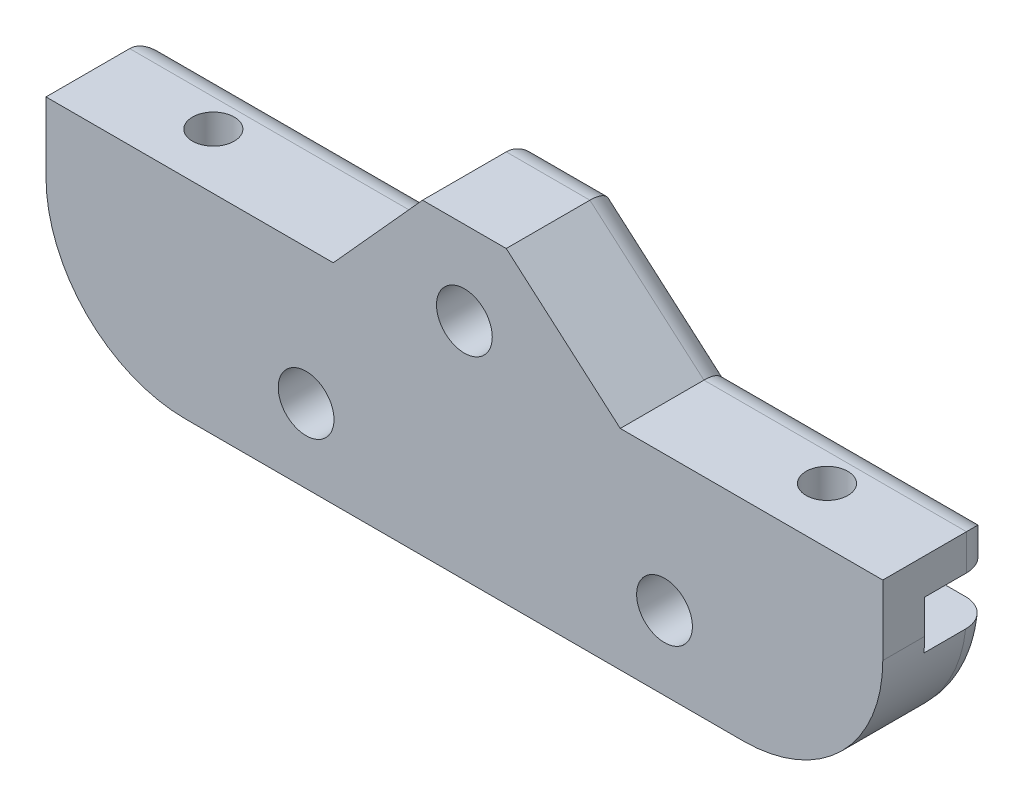
ISO-10303-21;
HEADER;
FILE_DESCRIPTION(('STEP AP214'),'2;1');
FILE_NAME('part.step','',(''),(''),'','','');
FILE_SCHEMA(('AUTOMOTIVE_DESIGN { 1 0 10303 214 1 1 1 1 }'));
ENDSEC;
DATA;
#1=APPLICATION_CONTEXT('core data for automotive mechanical design processes');
#2=APPLICATION_PROTOCOL_DEFINITION('international standard','automotive_design',2000,#1);
#3=PRODUCT_CONTEXT('',#1,'mechanical');
#4=PRODUCT('Part','Part','',(#3));
#5=PRODUCT_RELATED_PRODUCT_CATEGORY('part','',(#4));
#6=PRODUCT_DEFINITION_FORMATION('','',#4);
#7=PRODUCT_DEFINITION_CONTEXT('part definition',#1,'design');
#8=PRODUCT_DEFINITION('design','',#6,#7);
#9=PRODUCT_DEFINITION_SHAPE('','',#8);
#10=(LENGTH_UNIT() NAMED_UNIT(*) SI_UNIT(.MILLI.,.METRE.));
#11=(NAMED_UNIT(*) PLANE_ANGLE_UNIT() SI_UNIT($,.RADIAN.));
#12=(NAMED_UNIT(*) SI_UNIT($,.STERADIAN.) SOLID_ANGLE_UNIT());
#13=UNCERTAINTY_MEASURE_WITH_UNIT(LENGTH_MEASURE(1.E-05),#10,'distance_accuracy_value','');
#14=(GEOMETRIC_REPRESENTATION_CONTEXT(3) GLOBAL_UNCERTAINTY_ASSIGNED_CONTEXT((#13)) GLOBAL_UNIT_ASSIGNED_CONTEXT((#10,
#11,#12)) REPRESENTATION_CONTEXT('',''));
#15=CARTESIAN_POINT('',(0.,0.,0.));
#16=DIRECTION('',(0.,0.,1.));
#17=DIRECTION('',(1.,0.,0.));
#18=AXIS2_PLACEMENT_3D('',#15,#16,#17);
#19=CARTESIAN_POINT('',(0.,0.,1.));
#20=DIRECTION('',(0.,0.,-1.));
#21=DIRECTION('',(-1.,0.,0.));
#22=AXIS2_PLACEMENT_3D('',#19,#20,#21);
#23=PLANE('',#22);
#24=DIRECTION('',(-1.,0.,0.));
#25=VECTOR('',#24,1.);
#26=CARTESIAN_POINT('',(0.,3.65,1.));
#27=LINE('',#26,#25);
#28=CARTESIAN_POINT('',(-23.1180339887499,3.65,1.));
#29=VERTEX_POINT('',#28);
#30=CARTESIAN_POINT('',(-29.9433165477693,3.65,1.));
#31=VERTEX_POINT('',#30);
#32=EDGE_CURVE('E235',#29,#31,#27,.T.);
#33=ORIENTED_EDGE('',*,*,#32,.T.);
#34=CARTESIAN_POINT('',(-20.,4.71322905850847,1.));
#35=DIRECTION('',(0.,0.,-1.));
#36=DIRECTION('',(-1.,0.,0.));
#37=AXIS2_PLACEMENT_3D('',#34,#35,#36);
#38=CIRCLE('',#37,10.);
#39=CARTESIAN_POINT('',(-30.,4.71322905850847,1.));
#40=VERTEX_POINT('',#39);
#41=EDGE_CURVE('E335',#31,#40,#38,.T.);
#42=ORIENTED_EDGE('',*,*,#41,.T.);
#43=DIRECTION('',(0.,1.,0.));
#44=VECTOR('',#43,1.);
#45=CARTESIAN_POINT('',(-30.,0.,1.));
#46=LINE('',#45,#44);
#47=CARTESIAN_POINT('',(-30.,7.15,1.));
#48=VERTEX_POINT('',#47);
#49=EDGE_CURVE('E237',#40,#48,#46,.T.);
#50=ORIENTED_EDGE('',*,*,#49,.T.);
#51=DIRECTION('',(1.,0.,0.));
#52=VECTOR('',#51,1.);
#53=CARTESIAN_POINT('',(0.,7.15,1.));
#54=LINE('',#53,#52);
#55=CARTESIAN_POINT('',(-23.1180339887499,7.15,1.));
#56=VERTEX_POINT('',#55);
#57=EDGE_CURVE('E463',#48,#56,#54,.T.);
#58=ORIENTED_EDGE('',*,*,#57,.T.);
#59=DIRECTION('',(0.,1.,0.));
#60=VECTOR('',#59,1.);
#61=CARTESIAN_POINT('',(-23.1180339887499,-0.592640687119294,1.));
#62=LINE('',#61,#60);
#63=EDGE_CURVE('E313',#56,#29,#62,.F.);
#64=ORIENTED_EDGE('',*,*,#63,.T.);
#65=EDGE_LOOP('',(#33,#42,#50,#58,#64));
#66=FACE_BOUND('',#65,.T.);
#67=ADVANCED_FACE('F43',(#66),#23,.T.);
#68=CARTESIAN_POINT('',(20.8819660112501,3.65,1.));
#69=VERTEX_POINT('',#68);
#70=CARTESIAN_POINT('',(-20.8819660112501,3.65,1.));
#71=VERTEX_POINT('',#70);
#72=EDGE_CURVE('E224',#69,#71,#27,.T.);
#73=ORIENTED_EDGE('',*,*,#72,.T.);
#74=DIRECTION('',(0.,1.,0.));
#75=VECTOR('',#74,1.);
#76=CARTESIAN_POINT('',(-20.8819660112501,-0.592640687119294,1.));
#77=LINE('',#76,#75);
#78=CARTESIAN_POINT('',(-20.8819660112501,7.15,1.));
#79=VERTEX_POINT('',#78);
#80=EDGE_CURVE('E227',#71,#79,#77,.T.);
#81=ORIENTED_EDGE('',*,*,#80,.T.);
#82=CARTESIAN_POINT('',(20.8819660112501,7.15,1.));
#83=VERTEX_POINT('',#82);
#84=EDGE_CURVE('E226',#79,#83,#54,.T.);
#85=ORIENTED_EDGE('',*,*,#84,.T.);
#86=DIRECTION('',(0.,1.,0.));
#87=VECTOR('',#86,1.);
#88=CARTESIAN_POINT('',(20.8819660112501,-0.592640687119287,1.));
#89=LINE('',#88,#87);
#90=EDGE_CURVE('E209',#83,#69,#89,.F.);
#91=ORIENTED_EDGE('',*,*,#90,.T.);
#92=EDGE_LOOP('',(#73,#81,#85,#91));
#93=FACE_BOUND('',#92,.T.);
#94=ADVANCED_FACE('F222',(#93),#23,.T.);
#95=DIRECTION('',(0.,-1.,0.));
#96=VECTOR('',#95,1.);
#97=CARTESIAN_POINT('',(30.,0.,1.));
#98=LINE('',#97,#96);
#99=CARTESIAN_POINT('',(30.,7.15,1.));
#100=VERTEX_POINT('',#99);
#101=CARTESIAN_POINT('',(30.,4.71322905850846,1.));
#102=VERTEX_POINT('',#101);
#103=EDGE_CURVE('E239',#100,#102,#98,.T.);
#104=ORIENTED_EDGE('',*,*,#103,.T.);
#105=CARTESIAN_POINT('',(20.,4.71322905850846,1.));
#106=DIRECTION('',(0.,0.,-1.));
#107=DIRECTION('',(-1.,0.,0.));
#108=AXIS2_PLACEMENT_3D('',#105,#106,#107);
#109=CIRCLE('',#108,10.);
#110=CARTESIAN_POINT('',(29.9433165477693,3.65,1.));
#111=VERTEX_POINT('',#110);
#112=EDGE_CURVE('E319',#102,#111,#109,.T.);
#113=ORIENTED_EDGE('',*,*,#112,.T.);
#114=CARTESIAN_POINT('',(23.1180339887499,3.65,1.));
#115=VERTEX_POINT('',#114);
#116=EDGE_CURVE('E234',#111,#115,#27,.T.);
#117=ORIENTED_EDGE('',*,*,#116,.T.);
#118=DIRECTION('',(0.,1.,0.));
#119=VECTOR('',#118,1.);
#120=CARTESIAN_POINT('',(23.1180339887499,-0.592640687119287,1.));
#121=LINE('',#120,#119);
#122=CARTESIAN_POINT('',(23.1180339887499,7.15,1.));
#123=VERTEX_POINT('',#122);
#124=EDGE_CURVE('E212',#115,#123,#121,.T.);
#125=ORIENTED_EDGE('',*,*,#124,.T.);
#126=EDGE_CURVE('E251',#123,#100,#54,.T.);
#127=ORIENTED_EDGE('',*,*,#126,.T.);
#128=EDGE_LOOP('',(#104,#113,#117,#125,#127));
#129=FACE_BOUND('',#128,.T.);
#130=ADVANCED_FACE('F449',(#129),#23,.T.);
#131=CARTESIAN_POINT('',(0.,0.,-4.));
#132=DIRECTION('',(0.,0.,-1.));
#133=DIRECTION('',(-1.,0.,0.));
#134=AXIS2_PLACEMENT_3D('',#131,#132,#133);
#135=PLANE('',#134);
#136=DIRECTION('',(1.,0.,0.));
#137=VECTOR('',#136,1.);
#138=CARTESIAN_POINT('',(0.,7.15,-4.));
#139=LINE('',#138,#137);
#140=CARTESIAN_POINT('',(-28.,7.15,-4.));
#141=VERTEX_POINT('',#140);
#142=CARTESIAN_POINT('',(28.,7.15,-4.));
#143=VERTEX_POINT('',#142);
#144=EDGE_CURVE('E245',#141,#143,#139,.T.);
#145=ORIENTED_EDGE('',*,*,#144,.F.);
#146=DIRECTION('',(0.,-1.,0.));
#147=VECTOR('',#146,1.);
#148=CARTESIAN_POINT('',(-28.,9.71322905850846,-4.));
#149=LINE('',#148,#147);
#150=CARTESIAN_POINT('',(-28.,7.71322905850846,-4.));
#151=VERTEX_POINT('',#150);
#152=EDGE_CURVE('E512',#141,#151,#149,.F.);
#153=ORIENTED_EDGE('',*,*,#152,.T.);
#154=DIRECTION('',(-1.,0.,0.));
#155=VECTOR('',#154,1.);
#156=CARTESIAN_POINT('',(-9.40150542353064,7.71322905850847,-4.));
#157=LINE('',#156,#155);
#158=CARTESIAN_POINT('',(-8.51296332976873,7.71322905850846,-4.));
#159=VERTEX_POINT('',#158);
#160=EDGE_CURVE('E510',#151,#159,#157,.F.);
#161=ORIENTED_EDGE('',*,*,#160,.T.);
#162=DIRECTION('',(-0.670318033254231,-0.742073941257999,0.));
#163=VECTOR('',#162,1.);
#164=CARTESIAN_POINT('',(-8.5246224735656,7.70032183184914,-4.));
#165=LINE('',#164,#163);
#166=CARTESIAN_POINT('',(-2.11145790623808,14.8,-4.));
#167=VERTEX_POINT('',#166);
#168=EDGE_CURVE('E506',#159,#167,#165,.F.);
#169=ORIENTED_EDGE('',*,*,#168,.T.);
#170=DIRECTION('',(-1.,0.,0.));
#171=VECTOR('',#170,1.);
#172=CARTESIAN_POINT('',(0.,14.8,-4.));
#173=LINE('',#172,#171);
#174=CARTESIAN_POINT('',(2.25389483171771,14.8,-4.));
#175=VERTEX_POINT('',#174);
#176=EDGE_CURVE('E504',#167,#175,#173,.F.);
#177=ORIENTED_EDGE('',*,*,#176,.T.);
#178=DIRECTION('',(-0.755666938729322,0.654956088384142,0.));
#179=VECTOR('',#178,1.);
#180=CARTESIAN_POINT('',(8.29179178319719,9.56679848392303,-4.));
#181=LINE('',#180,#179);
#182=CARTESIAN_POINT('',(10.4303796339964,7.71322905850847,-4.));
#183=VERTEX_POINT('',#182);
#184=EDGE_CURVE('E502',#175,#183,#181,.F.);
#185=ORIENTED_EDGE('',*,*,#184,.T.);
#186=DIRECTION('',(-1.,0.,0.));
#187=VECTOR('',#186,1.);
#188=CARTESIAN_POINT('',(30.,7.71322905850847,-4.));
#189=LINE('',#188,#187);
#190=CARTESIAN_POINT('',(28.,7.71322905850847,-4.));
#191=VERTEX_POINT('',#190);
#192=EDGE_CURVE('E500',#183,#191,#189,.F.);
#193=ORIENTED_EDGE('',*,*,#192,.T.);
#194=DIRECTION('',(0.,1.,0.));
#195=VECTOR('',#194,1.);
#196=CARTESIAN_POINT('',(28.,7.15,-4.));
#197=LINE('',#196,#195);
#198=EDGE_CURVE('E508',#191,#143,#197,.F.);
#199=ORIENTED_EDGE('',*,*,#198,.T.);
#200=EDGE_LOOP('',(#145,#153,#161,#169,#177,#185,#193,#199));
#201=FACE_BOUND('',#200,.T.);
#202=CARTESIAN_POINT('',(0.,10.8,-4.));
#203=DIRECTION('',(0.,0.,1.));
#204=DIRECTION('',(1.,0.,0.));
#205=AXIS2_PLACEMENT_3D('',#202,#203,#204);
#206=CIRCLE('',#205,2.);
#207=CARTESIAN_POINT('',(2.,10.8,-4.));
#208=VERTEX_POINT('',#207);
#209=EDGE_CURVE('E281',#208,#208,#206,.T.);
#210=ORIENTED_EDGE('',*,*,#209,.T.);
#211=EDGE_LOOP('',(#210));
#212=FACE_BOUND('',#211,.T.);
#213=ADVANCED_FACE('F412',(#201,#212),#135,.T.);
#214=CARTESIAN_POINT('',(3.,16.8,-4.));
#215=DIRECTION('',(0.654956088384142,0.755666938729322,0.));
#216=DIRECTION('',(-0.755666938729322,0.654956088384142,0.));
#217=AXIS2_PLACEMENT_3D('',#214,#215,#216);
#218=PLANE('',#217);
#219=DIRECTION('',(0.,0.,-1.));
#220=VECTOR('',#219,1.);
#221=CARTESIAN_POINT('',(11.1764848022787,9.71322905850847,29.4813260804228));
#222=LINE('',#221,#220);
#223=CARTESIAN_POINT('',(11.1764848022787,9.71322905850847,4.));
#224=VERTEX_POINT('',#223);
#225=CARTESIAN_POINT('',(11.1764848022787,9.71322905850847,-2.));
#226=VERTEX_POINT('',#225);
#227=EDGE_CURVE('E260',#224,#226,#222,.T.);
#228=ORIENTED_EDGE('',*,*,#227,.T.);
#229=DIRECTION('',(-0.755666938729322,0.654956088384142,0.));
#230=VECTOR('',#229,1.);
#231=CARTESIAN_POINT('',(3.,16.8,-2.));
#232=LINE('',#231,#230);
#233=CARTESIAN_POINT('',(3.,16.8,-2.));
#234=VERTEX_POINT('',#233);
#235=EDGE_CURVE('E66',#226,#234,#232,.T.);
#236=ORIENTED_EDGE('',*,*,#235,.T.);
#237=DIRECTION('',(0.,0.,1.));
#238=VECTOR('',#237,1.);
#239=CARTESIAN_POINT('',(3.,16.8,-4.));
#240=LINE('',#239,#238);
#241=CARTESIAN_POINT('',(3.,16.8,4.));
#242=VERTEX_POINT('',#241);
#243=EDGE_CURVE('E307',#234,#242,#240,.T.);
#244=ORIENTED_EDGE('',*,*,#243,.T.);
#245=DIRECTION('',(-0.755666938729322,0.654956088384142,0.));
#246=VECTOR('',#245,1.);
#247=CARTESIAN_POINT('',(3.,16.8,4.));
#248=LINE('',#247,#246);
#249=EDGE_CURVE('E298',#224,#242,#248,.T.);
#250=ORIENTED_EDGE('',*,*,#249,.F.);
#251=EDGE_LOOP('',(#228,#236,#244,#250));
#252=FACE_BOUND('',#251,.T.);
#253=ADVANCED_FACE('F417',(#252),#218,.T.);
#254=CARTESIAN_POINT('',(-18.056919343382,0.131274222023489,-4.));
#255=DIRECTION('',(-0.742073941257999,0.670318033254231,0.));
#256=DIRECTION('',(-0.670318033254231,-0.742073941257999,0.));
#257=AXIS2_PLACEMENT_3D('',#254,#255,#256);
#258=PLANE('',#257);
#259=DIRECTION('',(0.,0.,1.));
#260=VECTOR('',#259,1.);
#261=CARTESIAN_POINT('',(-3.,16.8,-4.));
#262=LINE('',#261,#260);
#263=CARTESIAN_POINT('',(-3.,16.8,-2.));
#264=VERTEX_POINT('',#263);
#265=CARTESIAN_POINT('',(-3.,16.8,4.));
#266=VERTEX_POINT('',#265);
#267=EDGE_CURVE('E308',#264,#266,#262,.T.);
#268=ORIENTED_EDGE('',*,*,#267,.F.);
#269=DIRECTION('',(-0.670318033254231,-0.742073941257999,0.));
#270=VECTOR('',#269,1.);
#271=CARTESIAN_POINT('',(-18.056919343382,0.131274222023489,-2.));
#272=LINE('',#271,#270);
#273=CARTESIAN_POINT('',(-9.40150542353064,9.71322905850847,-2.));
#274=VERTEX_POINT('',#273);
#275=EDGE_CURVE('E516',#264,#274,#272,.T.);
#276=ORIENTED_EDGE('',*,*,#275,.T.);
#277=DIRECTION('',(0.,0.,-1.));
#278=VECTOR('',#277,1.);
#279=CARTESIAN_POINT('',(-9.40150542353064,9.71322905850847,29.4813260804228));
#280=LINE('',#279,#278);
#281=CARTESIAN_POINT('',(-9.40150542353064,9.71322905850847,4.));
#282=VERTEX_POINT('',#281);
#283=EDGE_CURVE('E274',#282,#274,#280,.T.);
#284=ORIENTED_EDGE('',*,*,#283,.F.);
#285=DIRECTION('',(-0.670318033254231,-0.742073941257999,0.));
#286=VECTOR('',#285,1.);
#287=CARTESIAN_POINT('',(-18.056919343382,0.131274222023489,4.));
#288=LINE('',#287,#286);
#289=EDGE_CURVE('E304',#266,#282,#288,.T.);
#290=ORIENTED_EDGE('',*,*,#289,.F.);
#291=EDGE_LOOP('',(#268,#276,#284,#290));
#292=FACE_BOUND('',#291,.T.);
#293=ADVANCED_FACE('F413',(#292),#258,.T.);
#294=CARTESIAN_POINT('',(-15.479170983648,-5.28677094149153,-4.));
#295=DIRECTION('',(0.,-1.,0.));
#296=DIRECTION('',(1.,0.,0.));
#297=AXIS2_PLACEMENT_3D('',#294,#295,#296);
#298=PLANE('',#297);
#299=DIRECTION('',(0.,0.,-1.));
#300=VECTOR('',#299,1.);
#301=CARTESIAN_POINT('',(-20.,-5.28677094149153,-4.));
#302=LINE('',#301,#300);
#303=CARTESIAN_POINT('',(-20.,-5.28677094149153,4.));
#304=VERTEX_POINT('',#303);
#305=CARTESIAN_POINT('',(-20.,-5.28677094149153,-2.));
#306=VERTEX_POINT('',#305);
#307=EDGE_CURVE('E326',#304,#306,#302,.T.);
#308=ORIENTED_EDGE('',*,*,#307,.T.);
#309=DIRECTION('',(1.,0.,0.));
#310=VECTOR('',#309,1.);
#311=CARTESIAN_POINT('',(-15.479170983648,-5.28677094149153,-2.));
#312=LINE('',#311,#310);
#313=CARTESIAN_POINT('',(20.,-5.28677094149154,-2.));
#314=VERTEX_POINT('',#313);
#315=EDGE_CURVE('E11',#306,#314,#312,.T.);
#316=ORIENTED_EDGE('',*,*,#315,.T.);
#317=DIRECTION('',(0.,0.,-1.));
#318=VECTOR('',#317,1.);
#319=CARTESIAN_POINT('',(20.,-5.28677094149154,4.));
#320=LINE('',#319,#318);
#321=CARTESIAN_POINT('',(20.,-5.28677094149154,4.));
#322=VERTEX_POINT('',#321);
#323=EDGE_CURVE('E329',#314,#322,#320,.F.);
#324=ORIENTED_EDGE('',*,*,#323,.T.);
#325=DIRECTION('',(1.,0.,0.));
#326=VECTOR('',#325,1.);
#327=CARTESIAN_POINT('',(-15.479170983648,-5.28677094149153,4.));
#328=LINE('',#327,#326);
#329=EDGE_CURVE('E285',#304,#322,#328,.T.);
#330=ORIENTED_EDGE('',*,*,#329,.F.);
#331=EDGE_LOOP('',(#308,#316,#324,#330));
#332=FACE_BOUND('',#331,.T.);
#333=ADVANCED_FACE('F416',(#332),#298,.T.);
#334=CARTESIAN_POINT('',(3.,16.8,-4.));
#335=DIRECTION('',(0.,1.,0.));
#336=DIRECTION('',(0.,0.,1.));
#337=AXIS2_PLACEMENT_3D('',#334,#335,#336);
#338=PLANE('',#337);
#339=ORIENTED_EDGE('',*,*,#243,.F.);
#340=DIRECTION('',(-1.,0.,0.));
#341=VECTOR('',#340,1.);
#342=CARTESIAN_POINT('',(3.,16.8,-2.));
#343=LINE('',#342,#341);
#344=EDGE_CURVE('E520',#234,#264,#343,.T.);
#345=ORIENTED_EDGE('',*,*,#344,.T.);
#346=ORIENTED_EDGE('',*,*,#267,.T.);
#347=DIRECTION('',(-1.,0.,0.));
#348=VECTOR('',#347,1.);
#349=CARTESIAN_POINT('',(3.,16.8,4.));
#350=LINE('',#349,#348);
#351=EDGE_CURVE('E301',#242,#266,#350,.T.);
#352=ORIENTED_EDGE('',*,*,#351,.F.);
#353=EDGE_LOOP('',(#339,#345,#346,#352));
#354=FACE_BOUND('',#353,.T.);
#355=ADVANCED_FACE('F410',(#354),#338,.T.);
#356=DIRECTION('',(1.,0.,0.));
#357=VECTOR('',#356,1.);
#358=CARTESIAN_POINT('',(0.,-3.28677094149154,-4.));
#359=LINE('',#358,#357);
#360=CARTESIAN_POINT('',(20.,-3.28677094149154,-4.));
#361=VERTEX_POINT('',#360);
#362=CARTESIAN_POINT('',(-20.,-3.28677094149153,-4.));
#363=VERTEX_POINT('',#362);
#364=EDGE_CURVE('E339',#361,#363,#359,.F.);
#365=ORIENTED_EDGE('',*,*,#364,.T.);
#366=CARTESIAN_POINT('',(-20.,4.71322905850847,-4.));
#367=DIRECTION('',(0.,0.,-1.));
#368=DIRECTION('',(-1.,0.,0.));
#369=AXIS2_PLACEMENT_3D('',#366,#367,#368);
#370=CIRCLE('',#369,8.);
#371=CARTESIAN_POINT('',(-27.9290317169969,3.65,-4.));
#372=VERTEX_POINT('',#371);
#373=EDGE_CURVE('E343',#363,#372,#370,.T.);
#374=ORIENTED_EDGE('',*,*,#373,.T.);
#375=DIRECTION('',(-1.,0.,0.));
#376=VECTOR('',#375,1.);
#377=CARTESIAN_POINT('',(0.,3.65,-4.));
#378=LINE('',#377,#376);
#379=CARTESIAN_POINT('',(27.9290317169969,3.65,-4.));
#380=VERTEX_POINT('',#379);
#381=EDGE_CURVE('E248',#380,#372,#378,.T.);
#382=ORIENTED_EDGE('',*,*,#381,.F.);
#383=CARTESIAN_POINT('',(20.,4.71322905850846,-4.));
#384=DIRECTION('',(0.,0.,-1.));
#385=DIRECTION('',(-1.,0.,0.));
#386=AXIS2_PLACEMENT_3D('',#383,#384,#385);
#387=CIRCLE('',#386,8.);
#388=EDGE_CURVE('E341',#380,#361,#387,.T.);
#389=ORIENTED_EDGE('',*,*,#388,.T.);
#390=EDGE_LOOP('',(#365,#374,#382,#389));
#391=FACE_BOUND('',#390,.T.);
#392=CARTESIAN_POINT('',(-11.35,0.,-4.));
#393=DIRECTION('',(0.,0.,1.));
#394=DIRECTION('',(1.,0.,0.));
#395=AXIS2_PLACEMENT_3D('',#392,#393,#394);
#396=CIRCLE('',#395,2.);
#397=CARTESIAN_POINT('',(-9.35,0.,-4.));
#398=VERTEX_POINT('',#397);
#399=EDGE_CURVE('E286',#398,#398,#396,.T.);
#400=ORIENTED_EDGE('',*,*,#399,.T.);
#401=EDGE_LOOP('',(#400));
#402=FACE_BOUND('',#401,.T.);
#403=CARTESIAN_POINT('',(14.35,0.,-4.));
#404=DIRECTION('',(0.,0.,1.));
#405=DIRECTION('',(1.,0.,0.));
#406=AXIS2_PLACEMENT_3D('',#403,#404,#405);
#407=CIRCLE('',#406,2.);
#408=CARTESIAN_POINT('',(16.35,0.,-4.));
#409=VERTEX_POINT('',#408);
#410=EDGE_CURVE('E270',#409,#409,#407,.T.);
#411=ORIENTED_EDGE('',*,*,#410,.T.);
#412=EDGE_LOOP('',(#411));
#413=FACE_BOUND('',#412,.T.);
#414=ADVANCED_FACE('F406',(#391,#402,#413),#135,.T.);
#415=CARTESIAN_POINT('',(0.,0.,4.));
#416=DIRECTION('',(0.,0.,-1.));
#417=DIRECTION('',(-1.,0.,0.));
#418=AXIS2_PLACEMENT_3D('',#415,#416,#417);
#419=PLANE('',#418);
#420=ORIENTED_EDGE('',*,*,#329,.T.);
#421=CARTESIAN_POINT('',(20.,4.71322905850846,4.));
#422=DIRECTION('',(0.,0.,-1.));
#423=DIRECTION('',(-1.,0.,0.));
#424=AXIS2_PLACEMENT_3D('',#421,#422,#423);
#425=CIRCLE('',#424,10.);
#426=CARTESIAN_POINT('',(30.,4.71322905850846,4.));
#427=VERTEX_POINT('',#426);
#428=EDGE_CURVE('E333',#322,#427,#425,.F.);
#429=ORIENTED_EDGE('',*,*,#428,.T.);
#430=DIRECTION('',(0.,-1.,0.));
#431=VECTOR('',#430,1.);
#432=CARTESIAN_POINT('',(30.,-5.28677094149153,4.));
#433=LINE('',#432,#431);
#434=CARTESIAN_POINT('',(30.,9.71322905850847,4.));
#435=VERTEX_POINT('',#434);
#436=EDGE_CURVE('E255',#435,#427,#433,.T.);
#437=ORIENTED_EDGE('',*,*,#436,.F.);
#438=DIRECTION('',(1.,0.,0.));
#439=VECTOR('',#438,1.);
#440=CARTESIAN_POINT('',(30.,9.71322905850847,4.));
#441=LINE('',#440,#439);
#442=EDGE_CURVE('E261',#224,#435,#441,.T.);
#443=ORIENTED_EDGE('',*,*,#442,.F.);
#444=ORIENTED_EDGE('',*,*,#249,.T.);
#445=ORIENTED_EDGE('',*,*,#351,.T.);
#446=ORIENTED_EDGE('',*,*,#289,.T.);
#447=DIRECTION('',(1.,0.,0.));
#448=VECTOR('',#447,1.);
#449=CARTESIAN_POINT('',(-9.40150542353064,9.71322905850847,4.));
#450=LINE('',#449,#448);
#451=CARTESIAN_POINT('',(-30.,9.71322905850846,4.));
#452=VERTEX_POINT('',#451);
#453=EDGE_CURVE('E271',#452,#282,#450,.T.);
#454=ORIENTED_EDGE('',*,*,#453,.F.);
#455=DIRECTION('',(0.,1.,0.));
#456=VECTOR('',#455,1.);
#457=CARTESIAN_POINT('',(-30.,-5.28677094149154,4.));
#458=LINE('',#457,#456);
#459=CARTESIAN_POINT('',(-30.,4.71322905850847,4.));
#460=VERTEX_POINT('',#459);
#461=EDGE_CURVE('E268',#460,#452,#458,.T.);
#462=ORIENTED_EDGE('',*,*,#461,.F.);
#463=CARTESIAN_POINT('',(-20.,4.71322905850847,4.));
#464=DIRECTION('',(0.,0.,-1.));
#465=DIRECTION('',(-1.,0.,0.));
#466=AXIS2_PLACEMENT_3D('',#463,#464,#465);
#467=CIRCLE('',#466,10.);
#468=EDGE_CURVE('E331',#460,#304,#467,.F.);
#469=ORIENTED_EDGE('',*,*,#468,.T.);
#470=EDGE_LOOP('',(#420,#429,#437,#443,#444,#445,#446,#454,#462,#469));
#471=FACE_BOUND('',#470,.T.);
#472=CARTESIAN_POINT('',(0.,10.8,4.));
#473=DIRECTION('',(0.,0.,1.));
#474=DIRECTION('',(1.,0.,0.));
#475=AXIS2_PLACEMENT_3D('',#472,#473,#474);
#476=CIRCLE('',#475,2.);
#477=CARTESIAN_POINT('',(2.,10.8,4.));
#478=VERTEX_POINT('',#477);
#479=EDGE_CURVE('E278',#478,#478,#476,.T.);
#480=ORIENTED_EDGE('',*,*,#479,.F.);
#481=EDGE_LOOP('',(#480));
#482=FACE_BOUND('',#481,.T.);
#483=CARTESIAN_POINT('',(-11.35,0.,4.));
#484=DIRECTION('',(0.,0.,1.));
#485=DIRECTION('',(1.,0.,0.));
#486=AXIS2_PLACEMENT_3D('',#483,#484,#485);
#487=CIRCLE('',#486,2.);
#488=CARTESIAN_POINT('',(-9.35,0.,4.));
#489=VERTEX_POINT('',#488);
#490=EDGE_CURVE('E282',#489,#489,#487,.T.);
#491=ORIENTED_EDGE('',*,*,#490,.F.);
#492=EDGE_LOOP('',(#491));
#493=FACE_BOUND('',#492,.T.);
#494=CARTESIAN_POINT('',(14.35,0.,4.));
#495=DIRECTION('',(0.,0.,1.));
#496=DIRECTION('',(1.,0.,0.));
#497=AXIS2_PLACEMENT_3D('',#494,#495,#496);
#498=CIRCLE('',#497,2.);
#499=CARTESIAN_POINT('',(16.35,0.,4.));
#500=VERTEX_POINT('',#499);
#501=EDGE_CURVE('E289',#500,#500,#498,.T.);
#502=ORIENTED_EDGE('',*,*,#501,.F.);
#503=EDGE_LOOP('',(#502));
#504=FACE_BOUND('',#503,.T.);
#505=ADVANCED_FACE('F402',(#471,#482,#493,#504),#419,.F.);
#506=CARTESIAN_POINT('',(14.35,0.,-4.));
#507=DIRECTION('',(0.,0.,1.));
#508=DIRECTION('',(1.,0.,0.));
#509=AXIS2_PLACEMENT_3D('',#506,#507,#508);
#510=CYLINDRICAL_SURFACE('',#509,2.);
#511=ORIENTED_EDGE('',*,*,#410,.F.);
#512=EDGE_LOOP('',(#511));
#513=FACE_BOUND('',#512,.T.);
#514=ORIENTED_EDGE('',*,*,#501,.T.);
#515=EDGE_LOOP('',(#514));
#516=FACE_BOUND('',#515,.T.);
#517=ADVANCED_FACE('F398',(#513,#516),#510,.F.);
#518=CARTESIAN_POINT('',(-11.35,0.,-4.));
#519=DIRECTION('',(0.,0.,1.));
#520=DIRECTION('',(1.,0.,0.));
#521=AXIS2_PLACEMENT_3D('',#518,#519,#520);
#522=CYLINDRICAL_SURFACE('',#521,2.);
#523=ORIENTED_EDGE('',*,*,#399,.F.);
#524=EDGE_LOOP('',(#523));
#525=FACE_BOUND('',#524,.T.);
#526=ORIENTED_EDGE('',*,*,#490,.T.);
#527=EDGE_LOOP('',(#526));
#528=FACE_BOUND('',#527,.T.);
#529=ADVANCED_FACE('F394',(#525,#528),#522,.F.);
#530=CARTESIAN_POINT('',(0.,10.8,-4.));
#531=DIRECTION('',(0.,0.,1.));
#532=DIRECTION('',(1.,0.,0.));
#533=AXIS2_PLACEMENT_3D('',#530,#531,#532);
#534=CYLINDRICAL_SURFACE('',#533,2.);
#535=ORIENTED_EDGE('',*,*,#209,.F.);
#536=EDGE_LOOP('',(#535));
#537=FACE_BOUND('',#536,.T.);
#538=ORIENTED_EDGE('',*,*,#479,.T.);
#539=EDGE_LOOP('',(#538));
#540=FACE_BOUND('',#539,.T.);
#541=ADVANCED_FACE('F387',(#537,#540),#534,.F.);
#542=CARTESIAN_POINT('',(-9.40150542353064,9.71322905850847,29.4813260804228));
#543=DIRECTION('',(0.,-1.,0.));
#544=DIRECTION('',(1.,0.,0.));
#545=AXIS2_PLACEMENT_3D('',#542,#543,#544);
#546=PLANE('',#545);
#547=CARTESIAN_POINT('',(-22.,9.71322905850846,0.));
#548=DIRECTION('',(0.,-1.,0.));
#549=DIRECTION('',(1.,0.,0.));
#550=AXIS2_PLACEMENT_3D('',#547,#548,#549);
#551=CIRCLE('',#550,1.5);
#552=CARTESIAN_POINT('',(-20.5,9.71322905850846,0.));
#553=VERTEX_POINT('',#552);
#554=EDGE_CURVE('E471',#553,#553,#551,.T.);
#555=ORIENTED_EDGE('',*,*,#554,.T.);
#556=EDGE_LOOP('',(#555));
#557=FACE_BOUND('',#556,.T.);
#558=ORIENTED_EDGE('',*,*,#283,.T.);
#559=DIRECTION('',(-1.,0.,0.));
#560=VECTOR('',#559,1.);
#561=CARTESIAN_POINT('',(-30.,9.71322905850846,-2.));
#562=LINE('',#561,#560);
#563=CARTESIAN_POINT('',(-30.,9.71322905850846,-2.));
#564=VERTEX_POINT('',#563);
#565=EDGE_CURVE('E518',#274,#564,#562,.T.);
#566=ORIENTED_EDGE('',*,*,#565,.T.);
#567=DIRECTION('',(0.,0.,-1.));
#568=VECTOR('',#567,1.);
#569=CARTESIAN_POINT('',(-30.,9.71322905850846,29.4813260804228));
#570=LINE('',#569,#568);
#571=EDGE_CURVE('E263',#452,#564,#570,.T.);
#572=ORIENTED_EDGE('',*,*,#571,.F.);
#573=ORIENTED_EDGE('',*,*,#453,.T.);
#574=EDGE_LOOP('',(#558,#566,#572,#573));
#575=FACE_BOUND('',#574,.T.);
#576=ADVANCED_FACE('F384',(#557,#575),#546,.F.);
#577=CARTESIAN_POINT('',(-30.,-5.28677094149154,29.4813260804228));
#578=DIRECTION('',(1.,0.,0.));
#579=DIRECTION('',(0.,0.,-1.));
#580=AXIS2_PLACEMENT_3D('',#577,#578,#579);
#581=PLANE('',#580);
#582=ORIENTED_EDGE('',*,*,#571,.T.);
#583=DIRECTION('',(0.,-1.,0.));
#584=VECTOR('',#583,1.);
#585=CARTESIAN_POINT('',(-30.,7.15,-2.));
#586=LINE('',#585,#584);
#587=CARTESIAN_POINT('',(-30.,7.15,-2.));
#588=VERTEX_POINT('',#587);
#589=EDGE_CURVE('E490',#564,#588,#586,.T.);
#590=ORIENTED_EDGE('',*,*,#589,.T.);
#591=DIRECTION('',(0.,0.,-1.));
#592=VECTOR('',#591,1.);
#593=CARTESIAN_POINT('',(-30.,7.15,1.));
#594=LINE('',#593,#592);
#595=EDGE_CURVE('E252',#48,#588,#594,.T.);
#596=ORIENTED_EDGE('',*,*,#595,.F.);
#597=ORIENTED_EDGE('',*,*,#49,.F.);
#598=DIRECTION('',(0.,0.,-1.));
#599=VECTOR('',#598,1.);
#600=CARTESIAN_POINT('',(-30.,4.71322905850847,4.));
#601=LINE('',#600,#599);
#602=EDGE_CURVE('E337',#40,#460,#601,.F.);
#603=ORIENTED_EDGE('',*,*,#602,.T.);
#604=ORIENTED_EDGE('',*,*,#461,.T.);
#605=EDGE_LOOP('',(#582,#590,#596,#597,#603,#604));
#606=FACE_BOUND('',#605,.T.);
#607=ADVANCED_FACE('F382',(#606),#581,.F.);
#608=CARTESIAN_POINT('',(30.,9.71322905850847,29.4813260804228));
#609=DIRECTION('',(0.,-1.,0.));
#610=DIRECTION('',(1.,0.,0.));
#611=AXIS2_PLACEMENT_3D('',#608,#609,#610);
#612=PLANE('',#611);
#613=CARTESIAN_POINT('',(22.,9.71322905850847,0.));
#614=DIRECTION('',(0.,-1.,0.));
#615=DIRECTION('',(1.,0.,0.));
#616=AXIS2_PLACEMENT_3D('',#613,#614,#615);
#617=CIRCLE('',#616,1.5);
#618=CARTESIAN_POINT('',(23.5,9.71322905850847,0.));
#619=VERTEX_POINT('',#618);
#620=EDGE_CURVE('E216',#619,#619,#617,.T.);
#621=ORIENTED_EDGE('',*,*,#620,.T.);
#622=EDGE_LOOP('',(#621));
#623=FACE_BOUND('',#622,.T.);
#624=DIRECTION('',(0.,0.,-1.));
#625=VECTOR('',#624,1.);
#626=CARTESIAN_POINT('',(30.,9.71322905850847,29.4813260804228));
#627=LINE('',#626,#625);
#628=CARTESIAN_POINT('',(30.,9.71322905850847,-2.));
#629=VERTEX_POINT('',#628);
#630=EDGE_CURVE('E258',#435,#629,#627,.T.);
#631=ORIENTED_EDGE('',*,*,#630,.T.);
#632=DIRECTION('',(-1.,0.,0.));
#633=VECTOR('',#632,1.);
#634=CARTESIAN_POINT('',(11.1764848022787,9.71322905850847,-2.));
#635=LINE('',#634,#633);
#636=EDGE_CURVE('E52',#629,#226,#635,.T.);
#637=ORIENTED_EDGE('',*,*,#636,.T.);
#638=ORIENTED_EDGE('',*,*,#227,.F.);
#639=ORIENTED_EDGE('',*,*,#442,.T.);
#640=EDGE_LOOP('',(#631,#637,#638,#639));
#641=FACE_BOUND('',#640,.T.);
#642=ADVANCED_FACE('F378',(#623,#641),#612,.F.);
#643=CARTESIAN_POINT('',(30.,-5.28677094149153,29.4813260804228));
#644=DIRECTION('',(-1.,0.,0.));
#645=DIRECTION('',(0.,0.,1.));
#646=AXIS2_PLACEMENT_3D('',#643,#644,#645);
#647=PLANE('',#646);
#648=DIRECTION('',(0.,0.,-1.));
#649=VECTOR('',#648,1.);
#650=CARTESIAN_POINT('',(30.,7.15,1.));
#651=LINE('',#650,#649);
#652=CARTESIAN_POINT('',(30.,7.15,-2.));
#653=VERTEX_POINT('',#652);
#654=EDGE_CURVE('E244',#100,#653,#651,.T.);
#655=ORIENTED_EDGE('',*,*,#654,.T.);
#656=DIRECTION('',(0.,1.,0.));
#657=VECTOR('',#656,1.);
#658=CARTESIAN_POINT('',(30.,9.71322905850847,-2.));
#659=LINE('',#658,#657);
#660=EDGE_CURVE('E514',#653,#629,#659,.T.);
#661=ORIENTED_EDGE('',*,*,#660,.T.);
#662=ORIENTED_EDGE('',*,*,#630,.F.);
#663=ORIENTED_EDGE('',*,*,#436,.T.);
#664=DIRECTION('',(0.,0.,-1.));
#665=VECTOR('',#664,1.);
#666=CARTESIAN_POINT('',(30.,4.71322905850846,-4.));
#667=LINE('',#666,#665);
#668=EDGE_CURVE('E316',#427,#102,#667,.T.);
#669=ORIENTED_EDGE('',*,*,#668,.T.);
#670=ORIENTED_EDGE('',*,*,#103,.F.);
#671=EDGE_LOOP('',(#655,#661,#662,#663,#669,#670));
#672=FACE_BOUND('',#671,.T.);
#673=ADVANCED_FACE('F374',(#672),#647,.F.);
#674=CARTESIAN_POINT('',(0.,7.15,1.));
#675=DIRECTION('',(0.,1.,0.));
#676=DIRECTION('',(0.,0.,1.));
#677=AXIS2_PLACEMENT_3D('',#674,#675,#676);
#678=PLANE('',#677);
#679=ORIENTED_EDGE('',*,*,#595,.T.);
#680=CARTESIAN_POINT('',(-28.,7.15,-2.));
#681=DIRECTION('',(0.,1.,0.));
#682=DIRECTION('',(0.,0.,1.));
#683=AXIS2_PLACEMENT_3D('',#680,#681,#682);
#684=CIRCLE('',#683,2.);
#685=EDGE_CURVE('E498',#588,#141,#684,.F.);
#686=ORIENTED_EDGE('',*,*,#685,.T.);
#687=ORIENTED_EDGE('',*,*,#144,.T.);
#688=CARTESIAN_POINT('',(28.,7.15,-2.));
#689=DIRECTION('',(0.,1.,0.));
#690=DIRECTION('',(0.,0.,1.));
#691=AXIS2_PLACEMENT_3D('',#688,#689,#690);
#692=CIRCLE('',#691,2.);
#693=EDGE_CURVE('E494',#143,#653,#692,.F.);
#694=ORIENTED_EDGE('',*,*,#693,.T.);
#695=ORIENTED_EDGE('',*,*,#654,.F.);
#696=ORIENTED_EDGE('',*,*,#126,.F.);
#697=CARTESIAN_POINT('',(22.,7.15,0.));
#698=DIRECTION('',(0.,1.,0.));
#699=DIRECTION('',(0.,0.,1.));
#700=AXIS2_PLACEMENT_3D('',#697,#698,#699);
#701=CIRCLE('',#700,1.5);
#702=EDGE_CURVE('E468',#83,#123,#701,.F.);
#703=ORIENTED_EDGE('',*,*,#702,.F.);
#704=ORIENTED_EDGE('',*,*,#84,.F.);
#705=CARTESIAN_POINT('',(-22.,7.15,0.));
#706=DIRECTION('',(0.,1.,0.));
#707=DIRECTION('',(0.,0.,1.));
#708=AXIS2_PLACEMENT_3D('',#705,#706,#707);
#709=CIRCLE('',#708,1.5);
#710=EDGE_CURVE('E249',#56,#79,#709,.F.);
#711=ORIENTED_EDGE('',*,*,#710,.F.);
#712=ORIENTED_EDGE('',*,*,#57,.F.);
#713=EDGE_LOOP('',(#679,#686,#687,#694,#695,#696,#703,#704,#711,#712));
#714=FACE_BOUND('',#713,.T.);
#715=ADVANCED_FACE('F369',(#714),#678,.F.);
#716=CARTESIAN_POINT('',(0.,3.65,1.));
#717=DIRECTION('',(0.,-1.,0.));
#718=DIRECTION('',(0.,0.,-1.));
#719=AXIS2_PLACEMENT_3D('',#716,#717,#718);
#720=PLANE('',#719);
#721=ORIENTED_EDGE('',*,*,#381,.T.);
#722=CARTESIAN_POINT('',(-27.9290317169969,3.65,-4.));
#723=CARTESIAN_POINT('',(-27.9860355331498,3.65,-3.99999941715019));
#724=CARTESIAN_POINT('',(-28.0430125580419,3.65,-3.9976044588539));
#725=CARTESIAN_POINT('',(-28.1565637956732,3.65,-3.98804308466886));
#726=CARTESIAN_POINT('',(-28.2131380145296,3.65,-3.98087674139949));
#727=CARTESIAN_POINT('',(-28.3815816622004,3.65,-3.95227254380897));
#728=CARTESIAN_POINT('',(-28.4923297608002,3.65,-3.92372940804471));
#729=CARTESIAN_POINT('',(-28.7074669690375,3.65,-3.84841976328557));
#730=CARTESIAN_POINT('',(-28.8118519690729,3.65,-3.8016416184476));
#731=CARTESIAN_POINT('',(-29.0112183488468,3.65,-3.69114329908933));
#732=CARTESIAN_POINT('',(-29.1062023041889,3.65,-3.6274277826299));
#733=CARTESIAN_POINT('',(-29.2835471519478,3.65,-3.4851953199911));
#734=CARTESIAN_POINT('',(-29.3659702095432,3.65,-3.40675586061652));
#735=CARTESIAN_POINT('',(-29.5163869070608,3.65,-3.23704771542643));
#736=CARTESIAN_POINT('',(-29.5843777887898,3.65,-3.14577658282695));
#737=CARTESIAN_POINT('',(-29.7035054629956,3.65,-2.95367289272323));
#738=CARTESIAN_POINT('',(-29.754750040435,3.65,-2.85290708567984));
#739=CARTESIAN_POINT('',(-29.8394705943511,3.65,-2.64419658136118));
#740=CARTESIAN_POINT('',(-29.8729585414961,3.65,-2.5362567758354));
#741=CARTESIAN_POINT('',(-29.9124508019425,3.65,-2.35632448411963));
#742=CARTESIAN_POINT('',(-29.9240188630915,3.65,-2.28550439749014));
#743=CARTESIAN_POINT('',(-29.9394501932121,3.65,-2.1431331901111));
#744=CARTESIAN_POINT('',(-29.9433245363482,3.65,-2.0715832692995));
#745=CARTESIAN_POINT('',(-29.9433165477693,3.65,-2.));
#746=B_SPLINE_CURVE_WITH_KNOTS('',3,(#722,#723,#724,#725,#726,#727,#728,#729,#730,#731,#732,
#733,#734,#735,#736,#737,#738,#739,#740,#741,#742,#743,#744,#745),.UNSPECIFIED.,.F.,.F.,(4,2,2,
2,2,2,2,2,2,2,2,4),(0.,0.170907620978815,0.341812640842188,0.683155631655444,1.02471679248557,
1.36618411528388,1.70590239135744,2.04568553406765,2.38323654814471,2.72055971126486,
2.93544923034848,3.15002921745299),.UNSPECIFIED.);
#747=CARTESIAN_POINT('',(-29.9433165477693,3.65,-2.));
#748=VERTEX_POINT('',#747);
#749=EDGE_CURVE('E354',#372,#748,#746,.T.);
#750=ORIENTED_EDGE('',*,*,#749,.T.);
#751=DIRECTION('',(0.,0.,1.));
#752=VECTOR('',#751,1.);
#753=CARTESIAN_POINT('',(-29.9433165477693,3.65,-4.));
#754=LINE('',#753,#752);
#755=EDGE_CURVE('E321',#748,#31,#754,.T.);
#756=ORIENTED_EDGE('',*,*,#755,.T.);
#757=ORIENTED_EDGE('',*,*,#32,.F.);
#758=CARTESIAN_POINT('',(-22.,3.65,0.));
#759=DIRECTION('',(0.,-1.,0.));
#760=DIRECTION('',(0.,0.,-1.));
#761=AXIS2_PLACEMENT_3D('',#758,#759,#760);
#762=CIRCLE('',#761,1.5);
#763=EDGE_CURVE('E232',#71,#29,#762,.T.);
#764=ORIENTED_EDGE('',*,*,#763,.F.);
#765=ORIENTED_EDGE('',*,*,#72,.F.);
#766=CARTESIAN_POINT('',(22.,3.65,0.));
#767=DIRECTION('',(0.,-1.,0.));
#768=DIRECTION('',(0.,0.,-1.));
#769=AXIS2_PLACEMENT_3D('',#766,#767,#768);
#770=CIRCLE('',#769,1.5);
#771=EDGE_CURVE('E206',#115,#69,#770,.T.);
#772=ORIENTED_EDGE('',*,*,#771,.F.);
#773=ORIENTED_EDGE('',*,*,#116,.F.);
#774=DIRECTION('',(0.,0.,1.));
#775=VECTOR('',#774,1.);
#776=CARTESIAN_POINT('',(29.9433165477693,3.65,1.));
#777=LINE('',#776,#775);
#778=CARTESIAN_POINT('',(29.9433165477693,3.65,-2.));
#779=VERTEX_POINT('',#778);
#780=EDGE_CURVE('E323',#111,#779,#777,.F.);
#781=ORIENTED_EDGE('',*,*,#780,.T.);
#782=CARTESIAN_POINT('',(29.9433165477693,3.65,-2.));
#783=CARTESIAN_POINT('',(29.9433163087709,3.65,-2.05602337735078));
#784=CARTESIAN_POINT('',(29.9409476666944,3.65,-2.11201984968875));
#785=CARTESIAN_POINT('',(29.9314991112219,3.65,-2.22361061197294));
#786=CARTESIAN_POINT('',(29.9244194673923,3.65,-2.27920492474699));
#787=CARTESIAN_POINT('',(29.8961856233697,3.65,-2.44467425555198));
#788=CARTESIAN_POINT('',(29.8680362981547,3.65,-2.55343849393203));
#789=CARTESIAN_POINT('',(29.7938859702845,3.65,-2.76469032684293));
#790=CARTESIAN_POINT('',(29.7478772114548,3.65,-2.86717517187469));
#791=CARTESIAN_POINT('',(29.6393465484045,3.65,-3.06298839788939));
#792=CARTESIAN_POINT('',(29.5768269171452,3.65,-3.15631803679575));
#793=CARTESIAN_POINT('',(29.4369241833026,3.65,-3.33140256607964));
#794=CARTESIAN_POINT('',(29.3595092504313,3.65,-3.41313200570537));
#795=CARTESIAN_POINT('',(29.1921069719522,3.65,-3.5625343188779));
#796=CARTESIAN_POINT('',(29.1021172060833,3.65,-3.63020448020446));
#797=CARTESIAN_POINT('',(28.9116086034849,3.65,-3.74996208657175));
#798=CARTESIAN_POINT('',(28.8110333629662,3.65,-3.80195969460202));
#799=CARTESIAN_POINT('',(28.6026373720908,3.65,-3.88844293050159));
#800=CARTESIAN_POINT('',(28.4948199416093,3.65,-3.92293652114274));
#801=CARTESIAN_POINT('',(28.3101964048587,3.65,-3.96544509982577));
#802=CARTESIAN_POINT('',(28.234488848122,3.65,-3.97839896168014));
#803=CARTESIAN_POINT('',(28.082207467305,3.65,-3.99567559760684));
#804=CARTESIAN_POINT('',(28.0056350729558,3.65,-4.00001097392007));
#805=CARTESIAN_POINT('',(27.9290317169969,3.65,-4.));
#806=B_SPLINE_CURVE_WITH_KNOTS('',3,(#782,#783,#784,#785,#786,#787,#788,#789,#790,#791,#792,
#793,#794,#795,#796,#797,#798,#799,#800,#801,#802,#803,#804,#805),.UNSPECIFIED.,.F.,.F.,(4,2,2,
2,2,2,2,2,2,2,2,4),(0.,0.167966670100551,0.335923729869081,0.671237127752198,1.00669631212939,
1.34210933973374,1.67824724748418,2.01444994058335,2.35254466051146,2.69048543920982,
2.92044845387251,3.15007496077727),.UNSPECIFIED.);
#807=EDGE_CURVE('E346',#779,#380,#806,.T.);
#808=ORIENTED_EDGE('',*,*,#807,.T.);
#809=EDGE_LOOP('',(#721,#750,#756,#757,#764,#765,#772,#773,#781,#808));
#810=FACE_BOUND('',#809,.T.);
#811=ADVANCED_FACE('F230',(#810),#720,.F.);
#812=CARTESIAN_POINT('',(22.,-0.592640687119287,0.));
#813=DIRECTION('',(0.,1.,0.));
#814=DIRECTION('',(0.,0.,1.));
#815=AXIS2_PLACEMENT_3D('',#812,#813,#814);
#816=CYLINDRICAL_SURFACE('',#815,1.5);
#817=ORIENTED_EDGE('',*,*,#620,.F.);
#818=EDGE_LOOP('',(#817));
#819=FACE_BOUND('',#818,.T.);
#820=ORIENTED_EDGE('',*,*,#702,.T.);
#821=ORIENTED_EDGE('',*,*,#124,.F.);
#822=ORIENTED_EDGE('',*,*,#771,.T.);
#823=ORIENTED_EDGE('',*,*,#90,.F.);
#824=EDGE_LOOP('',(#820,#821,#822,#823));
#825=FACE_BOUND('',#824,.T.);
#826=ADVANCED_FACE('F208',(#819,#825),#816,.F.);
#827=CARTESIAN_POINT('',(-22.,-0.592640687119294,0.));
#828=DIRECTION('',(0.,1.,0.));
#829=DIRECTION('',(0.,0.,1.));
#830=AXIS2_PLACEMENT_3D('',#827,#828,#829);
#831=CYLINDRICAL_SURFACE('',#830,1.5);
#832=ORIENTED_EDGE('',*,*,#554,.F.);
#833=EDGE_LOOP('',(#832));
#834=FACE_BOUND('',#833,.T.);
#835=ORIENTED_EDGE('',*,*,#710,.T.);
#836=ORIENTED_EDGE('',*,*,#80,.F.);
#837=ORIENTED_EDGE('',*,*,#763,.T.);
#838=ORIENTED_EDGE('',*,*,#63,.F.);
#839=EDGE_LOOP('',(#835,#836,#837,#838));
#840=FACE_BOUND('',#839,.T.);
#841=ADVANCED_FACE('F431',(#834,#840),#831,.F.);
#842=CARTESIAN_POINT('',(20.,4.71322905850846,29.4813260804228));
#843=DIRECTION('',(0.,0.,1.));
#844=DIRECTION('',(1.,0.,0.));
#845=AXIS2_PLACEMENT_3D('',#842,#843,#844);
#846=CYLINDRICAL_SURFACE('',#845,10.);
#847=ORIENTED_EDGE('',*,*,#323,.F.);
#848=CARTESIAN_POINT('',(20.,4.71322905850846,-2.));
#849=DIRECTION('',(0.,0.,-1.));
#850=DIRECTION('',(-1.,0.,0.));
#851=AXIS2_PLACEMENT_3D('',#848,#849,#850);
#852=CIRCLE('',#851,10.);
#853=EDGE_CURVE('E487',#314,#779,#852,.F.);
#854=ORIENTED_EDGE('',*,*,#853,.T.);
#855=ORIENTED_EDGE('',*,*,#780,.F.);
#856=ORIENTED_EDGE('',*,*,#112,.F.);
#857=ORIENTED_EDGE('',*,*,#668,.F.);
#858=ORIENTED_EDGE('',*,*,#428,.F.);
#859=EDGE_LOOP('',(#847,#854,#855,#856,#857,#858));
#860=FACE_BOUND('',#859,.T.);
#861=ADVANCED_FACE('F427',(#860),#846,.T.);
#862=CARTESIAN_POINT('',(-20.,4.71322905850847,-4.));
#863=DIRECTION('',(0.,0.,1.));
#864=DIRECTION('',(1.,0.,0.));
#865=AXIS2_PLACEMENT_3D('',#862,#863,#864);
#866=CYLINDRICAL_SURFACE('',#865,10.);
#867=ORIENTED_EDGE('',*,*,#755,.F.);
#868=CARTESIAN_POINT('',(-20.,4.71322905850847,-2.));
#869=DIRECTION('',(0.,0.,-1.));
#870=DIRECTION('',(-1.,0.,0.));
#871=AXIS2_PLACEMENT_3D('',#868,#869,#870);
#872=CIRCLE('',#871,10.);
#873=EDGE_CURVE('E491',#748,#306,#872,.F.);
#874=ORIENTED_EDGE('',*,*,#873,.T.);
#875=ORIENTED_EDGE('',*,*,#307,.F.);
#876=ORIENTED_EDGE('',*,*,#468,.F.);
#877=ORIENTED_EDGE('',*,*,#602,.F.);
#878=ORIENTED_EDGE('',*,*,#41,.F.);
#879=EDGE_LOOP('',(#867,#874,#875,#876,#877,#878));
#880=FACE_BOUND('',#879,.T.);
#881=ADVANCED_FACE('F430',(#880),#866,.T.);
#882=CARTESIAN_POINT('',(20.,4.71322905850846,-2.));
#883=DIRECTION('',(0.,0.,-1.));
#884=DIRECTION('',(-1.,0.,0.));
#885=AXIS2_PLACEMENT_3D('',#882,#883,#884);
#886=TOROIDAL_SURFACE('',#885,8.,2.);
#887=ORIENTED_EDGE('',*,*,#807,.F.);
#888=ORIENTED_EDGE('',*,*,#853,.F.);
#889=CARTESIAN_POINT('',(20.,-3.28677094149154,-2.));
#890=DIRECTION('',(-1.,0.,0.));
#891=DIRECTION('',(0.,0.,1.));
#892=AXIS2_PLACEMENT_3D('',#889,#890,#891);
#893=CIRCLE('',#892,2.);
#894=EDGE_CURVE('E217',#361,#314,#893,.T.);
#895=ORIENTED_EDGE('',*,*,#894,.F.);
#896=ORIENTED_EDGE('',*,*,#388,.F.);
#897=EDGE_LOOP('',(#887,#888,#895,#896));
#898=FACE_BOUND('',#897,.T.);
#899=ADVANCED_FACE('F361',(#898),#886,.T.);
#900=CARTESIAN_POINT('',(-15.479170983648,-3.28677094149153,-2.));
#901=DIRECTION('',(1.,0.,0.));
#902=DIRECTION('',(0.,1.,0.));
#903=AXIS2_PLACEMENT_3D('',#900,#901,#902);
#904=CYLINDRICAL_SURFACE('',#903,2.);
#905=ORIENTED_EDGE('',*,*,#894,.T.);
#906=ORIENTED_EDGE('',*,*,#315,.F.);
#907=CARTESIAN_POINT('',(-20.,-3.28677094149153,-2.));
#908=DIRECTION('',(-1.,0.,0.));
#909=DIRECTION('',(0.,0.,1.));
#910=AXIS2_PLACEMENT_3D('',#907,#908,#909);
#911=CIRCLE('',#910,2.);
#912=EDGE_CURVE('E524',#363,#306,#911,.T.);
#913=ORIENTED_EDGE('',*,*,#912,.F.);
#914=ORIENTED_EDGE('',*,*,#364,.F.);
#915=EDGE_LOOP('',(#905,#906,#913,#914));
#916=FACE_BOUND('',#915,.T.);
#917=ADVANCED_FACE('F438',(#916),#904,.T.);
#918=CARTESIAN_POINT('',(-20.,4.71322905850847,-2.));
#919=DIRECTION('',(0.,0.,-1.));
#920=DIRECTION('',(-1.,0.,0.));
#921=AXIS2_PLACEMENT_3D('',#918,#919,#920);
#922=TOROIDAL_SURFACE('',#921,8.,2.);
#923=ORIENTED_EDGE('',*,*,#912,.T.);
#924=ORIENTED_EDGE('',*,*,#873,.F.);
#925=ORIENTED_EDGE('',*,*,#749,.F.);
#926=ORIENTED_EDGE('',*,*,#373,.F.);
#927=EDGE_LOOP('',(#923,#924,#925,#926));
#928=FACE_BOUND('',#927,.T.);
#929=ADVANCED_FACE('F435',(#928),#922,.T.);
#930=CARTESIAN_POINT('',(28.,-5.28677094149153,-2.));
#931=DIRECTION('',(0.,-1.,0.));
#932=DIRECTION('',(0.,0.,-1.));
#933=AXIS2_PLACEMENT_3D('',#930,#931,#932);
#934=CYLINDRICAL_SURFACE('',#933,2.);
#935=ORIENTED_EDGE('',*,*,#693,.F.);
#936=ORIENTED_EDGE('',*,*,#198,.F.);
#937=CARTESIAN_POINT('',(28.,7.71322905850847,-2.));
#938=DIRECTION('',(0.707106781186548,-0.707106781186547,0.));
#939=DIRECTION('',(0.707106781186547,0.707106781186547,0.));
#940=AXIS2_PLACEMENT_3D('',#937,#938,#939);
#941=ELLIPSE('',#940,2.82842712474619,2.);
#942=EDGE_CURVE('E47',#629,#191,#941,.F.);
#943=ORIENTED_EDGE('',*,*,#942,.F.);
#944=ORIENTED_EDGE('',*,*,#660,.F.);
#945=EDGE_LOOP('',(#935,#936,#943,#944));
#946=FACE_BOUND('',#945,.T.);
#947=ADVANCED_FACE('F45',(#946),#934,.T.);
#948=CARTESIAN_POINT('',(30.,7.71322905850847,-2.));
#949=DIRECTION('',(1.,0.,0.));
#950=DIRECTION('',(0.,1.,0.));
#951=AXIS2_PLACEMENT_3D('',#948,#949,#950);
#952=CYLINDRICAL_SURFACE('',#951,2.);
#953=ORIENTED_EDGE('',*,*,#942,.T.);
#954=ORIENTED_EDGE('',*,*,#192,.F.);
#955=CARTESIAN_POINT('',(10.4303796339964,7.71322905850847,-2.));
#956=DIRECTION('',(-0.936927675631722,0.349523290547767,0.));
#957=DIRECTION('',(0.349523290547767,0.936927675631722,0.));
#958=AXIS2_PLACEMENT_3D('',#955,#956,#957);
#959=ELLIPSE('',#958,2.13463648477616,2.);
#960=EDGE_CURVE('E539',#226,#183,#959,.T.);
#961=ORIENTED_EDGE('',*,*,#960,.F.);
#962=ORIENTED_EDGE('',*,*,#636,.F.);
#963=EDGE_LOOP('',(#953,#954,#961,#962));
#964=FACE_BOUND('',#963,.T.);
#965=ADVANCED_FACE('F548',(#964),#952,.T.);
#966=CARTESIAN_POINT('',(1.69008782323172,15.2886661225414,-2.));
#967=DIRECTION('',(-0.755666938729322,0.654956088384142,0.));
#968=DIRECTION('',(-0.654956088384142,-0.755666938729322,0.));
#969=AXIS2_PLACEMENT_3D('',#966,#967,#968);
#970=CYLINDRICAL_SURFACE('',#969,2.);
#971=ORIENTED_EDGE('',*,*,#960,.T.);
#972=ORIENTED_EDGE('',*,*,#184,.F.);
#973=CARTESIAN_POINT('',(2.25389483171771,14.8,-2.));
#974=DIRECTION('',(-0.936927675631722,0.349523290547768,0.));
#975=DIRECTION('',(0.349523290547767,0.936927675631722,0.));
#976=AXIS2_PLACEMENT_3D('',#973,#974,#975);
#977=ELLIPSE('',#976,2.13463648477616,2.);
#978=EDGE_CURVE('E537',#234,#175,#977,.T.);
#979=ORIENTED_EDGE('',*,*,#978,.F.);
#980=ORIENTED_EDGE('',*,*,#235,.F.);
#981=EDGE_LOOP('',(#971,#972,#979,#980));
#982=FACE_BOUND('',#981,.T.);
#983=ADVANCED_FACE('F580',(#982),#970,.T.);
#984=CARTESIAN_POINT('',(3.,14.8,-2.));
#985=DIRECTION('',(-1.,0.,0.));
#986=DIRECTION('',(0.,0.,1.));
#987=AXIS2_PLACEMENT_3D('',#984,#985,#986);
#988=CYLINDRICAL_SURFACE('',#987,2.);
#989=ORIENTED_EDGE('',*,*,#978,.T.);
#990=ORIENTED_EDGE('',*,*,#176,.F.);
#991=CARTESIAN_POINT('',(-2.11145790623807,14.8,-2.));
#992=DIRECTION('',(-0.913870350009844,-0.406006137112341,0.));
#993=DIRECTION('',(-0.40600613711234,0.913870350009844,0.));
#994=AXIS2_PLACEMENT_3D('',#991,#992,#993);
#995=ELLIPSE('',#994,2.18849424316968,2.);
#996=EDGE_CURVE('E534',#264,#167,#995,.T.);
#997=ORIENTED_EDGE('',*,*,#996,.F.);
#998=ORIENTED_EDGE('',*,*,#344,.F.);
#999=EDGE_LOOP('',(#989,#990,#997,#998));
#1000=FACE_BOUND('',#999,.T.);
#1001=ADVANCED_FACE('F578',(#1000),#988,.T.);
#1002=CARTESIAN_POINT('',(-16.572771460866,-1.20936184448497,-2.));
#1003=DIRECTION('',(-0.670318033254231,-0.742073941257999,0.));
#1004=DIRECTION('',(0.742073941257999,-0.670318033254231,0.));
#1005=AXIS2_PLACEMENT_3D('',#1002,#1003,#1004);
#1006=CYLINDRICAL_SURFACE('',#1005,2.);
#1007=ORIENTED_EDGE('',*,*,#996,.T.);
#1008=ORIENTED_EDGE('',*,*,#168,.F.);
#1009=CARTESIAN_POINT('',(-8.51296332976872,7.71322905850846,-2.));
#1010=DIRECTION('',(-0.913870350009844,-0.406006137112341,0.));
#1011=DIRECTION('',(0.406006137112341,-0.913870350009844,0.));
#1012=AXIS2_PLACEMENT_3D('',#1009,#1010,#1011);
#1013=ELLIPSE('',#1012,2.18849424316967,2.);
#1014=EDGE_CURVE('E531',#274,#159,#1013,.T.);
#1015=ORIENTED_EDGE('',*,*,#1014,.F.);
#1016=ORIENTED_EDGE('',*,*,#275,.F.);
#1017=EDGE_LOOP('',(#1007,#1008,#1015,#1016));
#1018=FACE_BOUND('',#1017,.T.);
#1019=ADVANCED_FACE('F573',(#1018),#1006,.T.);
#1020=CARTESIAN_POINT('',(-9.40150542353064,7.71322905850847,-2.));
#1021=DIRECTION('',(1.,0.,0.));
#1022=DIRECTION('',(0.,1.,0.));
#1023=AXIS2_PLACEMENT_3D('',#1020,#1021,#1022);
#1024=CYLINDRICAL_SURFACE('',#1023,2.);
#1025=ORIENTED_EDGE('',*,*,#1014,.T.);
#1026=ORIENTED_EDGE('',*,*,#160,.F.);
#1027=CARTESIAN_POINT('',(-28.,7.71322905850846,-2.));
#1028=DIRECTION('',(0.707106781186547,0.707106781186548,0.));
#1029=DIRECTION('',(0.707106781186548,-0.707106781186547,0.));
#1030=AXIS2_PLACEMENT_3D('',#1027,#1028,#1029);
#1031=ELLIPSE('',#1030,2.82842712474619,2.);
#1032=EDGE_CURVE('E528',#564,#151,#1031,.F.);
#1033=ORIENTED_EDGE('',*,*,#1032,.F.);
#1034=ORIENTED_EDGE('',*,*,#565,.F.);
#1035=EDGE_LOOP('',(#1025,#1026,#1033,#1034));
#1036=FACE_BOUND('',#1035,.T.);
#1037=ADVANCED_FACE('F568',(#1036),#1024,.T.);
#1038=CARTESIAN_POINT('',(-28.,-5.28677094149154,-2.));
#1039=DIRECTION('',(0.,1.,0.));
#1040=DIRECTION('',(0.,0.,1.));
#1041=AXIS2_PLACEMENT_3D('',#1038,#1039,#1040);
#1042=CYLINDRICAL_SURFACE('',#1041,2.);
#1043=ORIENTED_EDGE('',*,*,#1032,.T.);
#1044=ORIENTED_EDGE('',*,*,#152,.F.);
#1045=ORIENTED_EDGE('',*,*,#685,.F.);
#1046=ORIENTED_EDGE('',*,*,#589,.F.);
#1047=EDGE_LOOP('',(#1043,#1044,#1045,#1046));
#1048=FACE_BOUND('',#1047,.T.);
#1049=ADVANCED_FACE('F559',(#1048),#1042,.T.);
#1050=CLOSED_SHELL('',(#67,#94,#130,#213,#253,#293,#333,#355,#414,#505,#517,#529,#541,#576,#607,
#642,#673,#715,#811,#826,#841,#861,#881,#899,#917,#929,#947,#965,#983,#1001,#1019,#1037,#1049));
#1051=MANIFOLD_SOLID_BREP('B2',#1050);
#1052=ADVANCED_BREP_SHAPE_REPRESENTATION('',(#18,#1051),#14);
#1053=SHAPE_DEFINITION_REPRESENTATION(#9,#1052);
ENDSEC;
END-ISO-10303-21;
